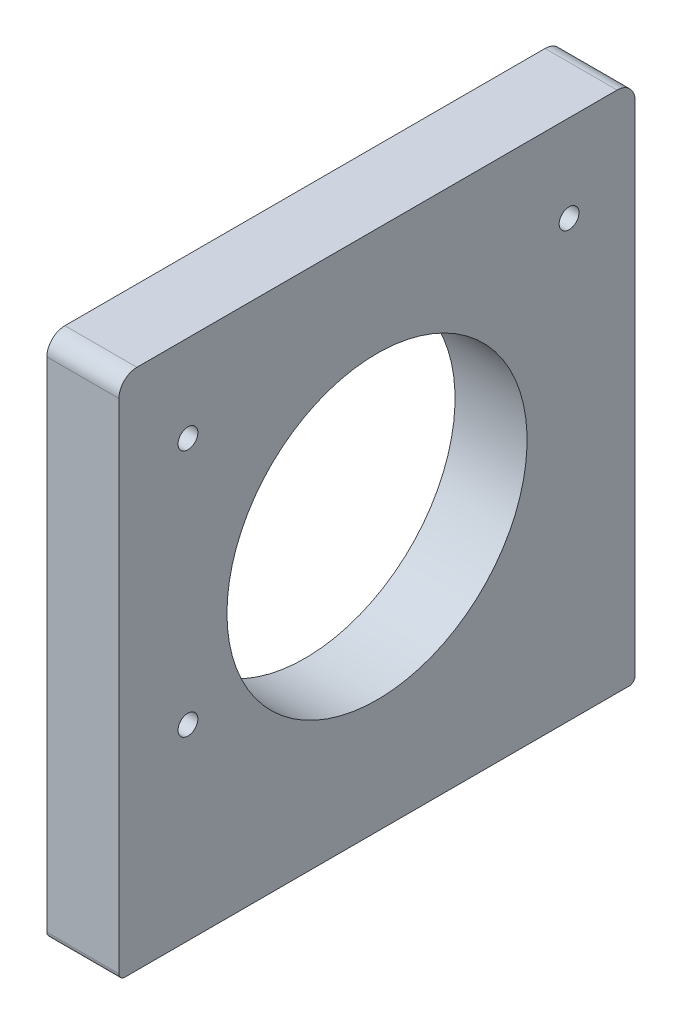
ISO-10303-21;
HEADER;
FILE_DESCRIPTION(('STEP AP214'),'2;1');
FILE_NAME('part.step','',(''),(''),'','','');
FILE_SCHEMA(('AUTOMOTIVE_DESIGN { 1 0 10303 214 1 1 1 1 }'));
ENDSEC;
DATA;
#1=APPLICATION_CONTEXT('core data for automotive mechanical design processes');
#2=APPLICATION_PROTOCOL_DEFINITION('international standard','automotive_design',2000,#1);
#3=PRODUCT_CONTEXT('',#1,'mechanical');
#4=PRODUCT('Part','Part','',(#3));
#5=PRODUCT_RELATED_PRODUCT_CATEGORY('part','',(#4));
#6=PRODUCT_DEFINITION_FORMATION('','',#4);
#7=PRODUCT_DEFINITION_CONTEXT('part definition',#1,'design');
#8=PRODUCT_DEFINITION('design','',#6,#7);
#9=PRODUCT_DEFINITION_SHAPE('','',#8);
#10=(LENGTH_UNIT() NAMED_UNIT(*) SI_UNIT(.MILLI.,.METRE.));
#11=(NAMED_UNIT(*) PLANE_ANGLE_UNIT() SI_UNIT($,.RADIAN.));
#12=(NAMED_UNIT(*) SI_UNIT($,.STERADIAN.) SOLID_ANGLE_UNIT());
#13=UNCERTAINTY_MEASURE_WITH_UNIT(LENGTH_MEASURE(1.E-05),#10,'distance_accuracy_value','');
#14=(GEOMETRIC_REPRESENTATION_CONTEXT(3) GLOBAL_UNCERTAINTY_ASSIGNED_CONTEXT((#13)) GLOBAL_UNIT_ASSIGNED_CONTEXT((#10,
#11,#12)) REPRESENTATION_CONTEXT('',''));
#15=CARTESIAN_POINT('',(0.,0.,0.));
#16=DIRECTION('',(0.,0.,1.));
#17=DIRECTION('',(1.,0.,0.));
#18=AXIS2_PLACEMENT_3D('',#15,#16,#17);
#19=CARTESIAN_POINT('',(0.,12.,86.));
#20=DIRECTION('',(0.,0.,-1.));
#21=DIRECTION('',(-1.,0.,0.));
#22=AXIS2_PLACEMENT_3D('',#19,#20,#21);
#23=PLANE('',#22);
#24=DIRECTION('',(0.,-1.,0.));
#25=VECTOR('',#24,1.);
#26=CARTESIAN_POINT('',(28.,99.,86.));
#27=LINE('',#26,#25);
#28=CARTESIAN_POINT('',(28.,96.,86.));
#29=VERTEX_POINT('',#28);
#30=CARTESIAN_POINT('',(28.,13.,86.));
#31=VERTEX_POINT('',#30);
#32=EDGE_CURVE('E124',#29,#31,#27,.T.);
#33=ORIENTED_EDGE('',*,*,#32,.T.);
#34=DIRECTION('',(-1.,0.,0.));
#35=VECTOR('',#34,1.);
#36=CARTESIAN_POINT('',(0.,13.,86.));
#37=LINE('',#36,#35);
#38=CARTESIAN_POINT('',(40.,13.,86.));
#39=VERTEX_POINT('',#38);
#40=EDGE_CURVE('E11',#31,#39,#37,.F.);
#41=ORIENTED_EDGE('',*,*,#40,.T.);
#42=DIRECTION('',(0.,-1.,0.));
#43=VECTOR('',#42,1.);
#44=CARTESIAN_POINT('',(40.,12.,86.));
#45=LINE('',#44,#43);
#46=CARTESIAN_POINT('',(40.,96.,86.));
#47=VERTEX_POINT('',#46);
#48=EDGE_CURVE('E140',#47,#39,#45,.T.);
#49=ORIENTED_EDGE('',*,*,#48,.F.);
#50=DIRECTION('',(1.,0.,0.));
#51=VECTOR('',#50,1.);
#52=CARTESIAN_POINT('',(0.,96.,86.));
#53=LINE('',#52,#51);
#54=EDGE_CURVE('E104',#47,#29,#53,.F.);
#55=ORIENTED_EDGE('',*,*,#54,.T.);
#56=EDGE_LOOP('',(#33,#41,#49,#55));
#57=FACE_BOUND('',#56,.T.);
#58=ADVANCED_FACE('F33',(#57),#23,.F.);
#59=CARTESIAN_POINT('',(40.,12.,0.));
#60=DIRECTION('',(-1.,0.,0.));
#61=DIRECTION('',(0.,0.,1.));
#62=AXIS2_PLACEMENT_3D('',#59,#60,#61);
#63=PLANE('',#62);
#64=CARTESIAN_POINT('',(40.,56.,43.));
#65=DIRECTION('',(-1.,0.,0.));
#66=DIRECTION('',(0.,0.,1.));
#67=AXIS2_PLACEMENT_3D('',#64,#65,#66);
#68=CIRCLE('',#67,25.);
#69=CARTESIAN_POINT('',(40.,56.,68.));
#70=VERTEX_POINT('',#69);
#71=EDGE_CURVE('E382',#70,#70,#68,.T.);
#72=ORIENTED_EDGE('',*,*,#71,.T.);
#73=EDGE_LOOP('',(#72));
#74=FACE_BOUND('',#73,.T.);
#75=CARTESIAN_POINT('',(40.,43.2000000000002,74.4999999999985));
#76=DIRECTION('',(-1.,0.,0.));
#77=DIRECTION('',(0.,0.,1.));
#78=AXIS2_PLACEMENT_3D('',#75,#76,#77);
#79=CIRCLE('',#78,1.65);
#80=CARTESIAN_POINT('',(40.,43.2000000000002,76.1499999999985));
#81=VERTEX_POINT('',#80);
#82=EDGE_CURVE('E369',#81,#81,#79,.T.);
#83=ORIENTED_EDGE('',*,*,#82,.T.);
#84=EDGE_LOOP('',(#83));
#85=FACE_BOUND('',#84,.T.);
#86=CARTESIAN_POINT('',(40.,84.5000000000002,10.9999999999985));
#87=DIRECTION('',(-1.,0.,0.));
#88=DIRECTION('',(0.,0.,1.));
#89=AXIS2_PLACEMENT_3D('',#86,#87,#88);
#90=CIRCLE('',#89,1.65);
#91=CARTESIAN_POINT('',(40.,84.5000000000002,12.6499999999985));
#92=VERTEX_POINT('',#91);
#93=EDGE_CURVE('E375',#92,#92,#90,.T.);
#94=ORIENTED_EDGE('',*,*,#93,.T.);
#95=EDGE_LOOP('',(#94));
#96=FACE_BOUND('',#95,.T.);
#97=CARTESIAN_POINT('',(40.,84.5000000000002,74.4999999999985));
#98=DIRECTION('',(-1.,0.,0.));
#99=DIRECTION('',(0.,0.,1.));
#100=AXIS2_PLACEMENT_3D('',#97,#98,#99);
#101=CIRCLE('',#100,1.65);
#102=CARTESIAN_POINT('',(40.,84.5000000000002,76.1499999999985));
#103=VERTEX_POINT('',#102);
#104=EDGE_CURVE('E127',#103,#103,#101,.T.);
#105=ORIENTED_EDGE('',*,*,#104,.T.);
#106=EDGE_LOOP('',(#105));
#107=FACE_BOUND('',#106,.T.);
#108=DIRECTION('',(0.,0.,1.));
#109=VECTOR('',#108,1.);
#110=CARTESIAN_POINT('',(40.,12.,0.));
#111=LINE('',#110,#109);
#112=CARTESIAN_POINT('',(40.,12.,1.));
#113=VERTEX_POINT('',#112);
#114=CARTESIAN_POINT('',(40.,12.,85.));
#115=VERTEX_POINT('',#114);
#116=EDGE_CURVE('E164',#113,#115,#111,.T.);
#117=ORIENTED_EDGE('',*,*,#116,.F.);
#118=CARTESIAN_POINT('',(40.,13.,1.));
#119=DIRECTION('',(-1.,0.,0.));
#120=DIRECTION('',(0.,0.,1.));
#121=AXIS2_PLACEMENT_3D('',#118,#119,#120);
#122=CIRCLE('',#121,1.);
#123=CARTESIAN_POINT('',(40.,13.,0.));
#124=VERTEX_POINT('',#123);
#125=EDGE_CURVE('E41',#113,#124,#122,.F.);
#126=ORIENTED_EDGE('',*,*,#125,.T.);
#127=DIRECTION('',(0.,-1.,0.));
#128=VECTOR('',#127,1.);
#129=CARTESIAN_POINT('',(40.,12.,0.));
#130=LINE('',#129,#128);
#131=CARTESIAN_POINT('',(40.,96.,0.));
#132=VERTEX_POINT('',#131);
#133=EDGE_CURVE('E137',#132,#124,#130,.T.);
#134=ORIENTED_EDGE('',*,*,#133,.F.);
#135=CARTESIAN_POINT('',(40.,96.,3.));
#136=DIRECTION('',(-1.,0.,0.));
#137=DIRECTION('',(0.,0.,1.));
#138=AXIS2_PLACEMENT_3D('',#135,#136,#137);
#139=CIRCLE('',#138,3.);
#140=CARTESIAN_POINT('',(40.,99.,3.));
#141=VERTEX_POINT('',#140);
#142=EDGE_CURVE('E106',#132,#141,#139,.F.);
#143=ORIENTED_EDGE('',*,*,#142,.T.);
#144=DIRECTION('',(0.,0.,-1.));
#145=VECTOR('',#144,1.);
#146=CARTESIAN_POINT('',(40.,99.,0.));
#147=LINE('',#146,#145);
#148=CARTESIAN_POINT('',(40.,99.,83.));
#149=VERTEX_POINT('',#148);
#150=EDGE_CURVE('E113',#149,#141,#147,.T.);
#151=ORIENTED_EDGE('',*,*,#150,.F.);
#152=CARTESIAN_POINT('',(40.,96.,83.));
#153=DIRECTION('',(-1.,0.,0.));
#154=DIRECTION('',(0.,0.,1.));
#155=AXIS2_PLACEMENT_3D('',#152,#153,#154);
#156=CIRCLE('',#155,3.);
#157=EDGE_CURVE('E99',#149,#47,#156,.F.);
#158=ORIENTED_EDGE('',*,*,#157,.T.);
#159=ORIENTED_EDGE('',*,*,#48,.T.);
#160=CARTESIAN_POINT('',(40.,13.,85.));
#161=DIRECTION('',(-1.,0.,0.));
#162=DIRECTION('',(0.,0.,1.));
#163=AXIS2_PLACEMENT_3D('',#160,#161,#162);
#164=CIRCLE('',#163,1.);
#165=EDGE_CURVE('E53',#39,#115,#164,.F.);
#166=ORIENTED_EDGE('',*,*,#165,.T.);
#167=EDGE_LOOP('',(#117,#126,#134,#143,#151,#158,#159,#166));
#168=FACE_BOUND('',#167,.T.);
#169=ADVANCED_FACE('F119',(#74,#85,#96,#107,#168),#63,.F.);
#170=CARTESIAN_POINT('',(0.,12.,0.));
#171=DIRECTION('',(0.,0.,1.));
#172=DIRECTION('',(1.,0.,0.));
#173=AXIS2_PLACEMENT_3D('',#170,#171,#172);
#174=PLANE('',#173);
#175=ORIENTED_EDGE('',*,*,#133,.T.);
#176=DIRECTION('',(-1.,0.,0.));
#177=VECTOR('',#176,1.);
#178=CARTESIAN_POINT('',(0.,13.,0.));
#179=LINE('',#178,#177);
#180=CARTESIAN_POINT('',(28.,13.,0.));
#181=VERTEX_POINT('',#180);
#182=EDGE_CURVE('E151',#124,#181,#179,.T.);
#183=ORIENTED_EDGE('',*,*,#182,.T.);
#184=DIRECTION('',(0.,-1.,0.));
#185=VECTOR('',#184,1.);
#186=CARTESIAN_POINT('',(28.,99.,0.));
#187=LINE('',#186,#185);
#188=CARTESIAN_POINT('',(28.,96.,0.));
#189=VERTEX_POINT('',#188);
#190=EDGE_CURVE('E134',#189,#181,#187,.T.);
#191=ORIENTED_EDGE('',*,*,#190,.F.);
#192=DIRECTION('',(-1.,0.,0.));
#193=VECTOR('',#192,1.);
#194=CARTESIAN_POINT('',(0.,96.,0.));
#195=LINE('',#194,#193);
#196=EDGE_CURVE('E149',#189,#132,#195,.F.);
#197=ORIENTED_EDGE('',*,*,#196,.T.);
#198=EDGE_LOOP('',(#175,#183,#191,#197));
#199=FACE_BOUND('',#198,.T.);
#200=ADVANCED_FACE('F169',(#199),#174,.F.);
#201=CARTESIAN_POINT('',(28.,99.,0.));
#202=DIRECTION('',(1.,0.,0.));
#203=DIRECTION('',(0.,0.,-1.));
#204=AXIS2_PLACEMENT_3D('',#201,#202,#203);
#205=PLANE('',#204);
#206=CARTESIAN_POINT('',(28.,56.,43.));
#207=DIRECTION('',(-1.,0.,0.));
#208=DIRECTION('',(0.,0.,1.));
#209=AXIS2_PLACEMENT_3D('',#206,#207,#208);
#210=CIRCLE('',#209,25.);
#211=CARTESIAN_POINT('',(28.,56.,68.));
#212=VERTEX_POINT('',#211);
#213=EDGE_CURVE('E357',#212,#212,#210,.T.);
#214=ORIENTED_EDGE('',*,*,#213,.F.);
#215=EDGE_LOOP('',(#214));
#216=FACE_BOUND('',#215,.T.);
#217=CARTESIAN_POINT('',(28.,43.2000000000002,74.4999999999985));
#218=DIRECTION('',(-1.,0.,0.));
#219=DIRECTION('',(0.,0.,1.));
#220=AXIS2_PLACEMENT_3D('',#217,#218,#219);
#221=CIRCLE('',#220,1.65);
#222=CARTESIAN_POINT('',(28.,43.2000000000002,76.1499999999985));
#223=VERTEX_POINT('',#222);
#224=EDGE_CURVE('E361',#223,#223,#221,.T.);
#225=ORIENTED_EDGE('',*,*,#224,.F.);
#226=EDGE_LOOP('',(#225));
#227=FACE_BOUND('',#226,.T.);
#228=CARTESIAN_POINT('',(28.,84.5000000000002,10.9999999999985));
#229=DIRECTION('',(-1.,0.,0.));
#230=DIRECTION('',(0.,0.,1.));
#231=AXIS2_PLACEMENT_3D('',#228,#229,#230);
#232=CIRCLE('',#231,1.65);
#233=CARTESIAN_POINT('',(28.,84.5000000000002,12.6499999999985));
#234=VERTEX_POINT('',#233);
#235=EDGE_CURVE('E365',#234,#234,#232,.T.);
#236=ORIENTED_EDGE('',*,*,#235,.F.);
#237=EDGE_LOOP('',(#236));
#238=FACE_BOUND('',#237,.T.);
#239=CARTESIAN_POINT('',(28.,84.5000000000002,74.4999999999985));
#240=DIRECTION('',(-1.,0.,0.));
#241=DIRECTION('',(0.,0.,1.));
#242=AXIS2_PLACEMENT_3D('',#239,#240,#241);
#243=CIRCLE('',#242,1.65);
#244=CARTESIAN_POINT('',(28.,84.5000000000002,76.1499999999985));
#245=VERTEX_POINT('',#244);
#246=EDGE_CURVE('E130',#245,#245,#243,.T.);
#247=ORIENTED_EDGE('',*,*,#246,.F.);
#248=EDGE_LOOP('',(#247));
#249=FACE_BOUND('',#248,.T.);
#250=ORIENTED_EDGE('',*,*,#190,.T.);
#251=CARTESIAN_POINT('',(28.,13.,1.));
#252=DIRECTION('',(1.,0.,0.));
#253=DIRECTION('',(0.,0.,-1.));
#254=AXIS2_PLACEMENT_3D('',#251,#252,#253);
#255=CIRCLE('',#254,1.);
#256=CARTESIAN_POINT('',(28.,12.,1.));
#257=VERTEX_POINT('',#256);
#258=EDGE_CURVE('E156',#181,#257,#255,.F.);
#259=ORIENTED_EDGE('',*,*,#258,.T.);
#260=DIRECTION('',(0.,0.,1.));
#261=VECTOR('',#260,1.);
#262=CARTESIAN_POINT('',(28.,12.,0.));
#263=LINE('',#262,#261);
#264=CARTESIAN_POINT('',(28.,12.,85.));
#265=VERTEX_POINT('',#264);
#266=EDGE_CURVE('E122',#257,#265,#263,.T.);
#267=ORIENTED_EDGE('',*,*,#266,.T.);
#268=CARTESIAN_POINT('',(28.,13.,85.));
#269=DIRECTION('',(1.,0.,0.));
#270=DIRECTION('',(0.,0.,-1.));
#271=AXIS2_PLACEMENT_3D('',#268,#269,#270);
#272=CIRCLE('',#271,1.);
#273=EDGE_CURVE('E154',#265,#31,#272,.F.);
#274=ORIENTED_EDGE('',*,*,#273,.T.);
#275=ORIENTED_EDGE('',*,*,#32,.F.);
#276=CARTESIAN_POINT('',(28.,96.,83.));
#277=DIRECTION('',(1.,0.,0.));
#278=DIRECTION('',(0.,0.,-1.));
#279=AXIS2_PLACEMENT_3D('',#276,#277,#278);
#280=CIRCLE('',#279,3.);
#281=CARTESIAN_POINT('',(28.,99.,83.));
#282=VERTEX_POINT('',#281);
#283=EDGE_CURVE('E147',#29,#282,#280,.F.);
#284=ORIENTED_EDGE('',*,*,#283,.T.);
#285=DIRECTION('',(0.,0.,1.));
#286=VECTOR('',#285,1.);
#287=CARTESIAN_POINT('',(28.,99.,0.));
#288=LINE('',#287,#286);
#289=CARTESIAN_POINT('',(28.,99.,3.));
#290=VERTEX_POINT('',#289);
#291=EDGE_CURVE('E116',#290,#282,#288,.T.);
#292=ORIENTED_EDGE('',*,*,#291,.F.);
#293=CARTESIAN_POINT('',(28.,96.,3.));
#294=DIRECTION('',(1.,0.,0.));
#295=DIRECTION('',(0.,0.,-1.));
#296=AXIS2_PLACEMENT_3D('',#293,#294,#295);
#297=CIRCLE('',#296,3.);
#298=EDGE_CURVE('E145',#290,#189,#297,.F.);
#299=ORIENTED_EDGE('',*,*,#298,.T.);
#300=EDGE_LOOP('',(#250,#259,#267,#274,#275,#284,#292,#299));
#301=FACE_BOUND('',#300,.T.);
#302=ADVANCED_FACE('F175',(#216,#227,#238,#249,#301),#205,.F.);
#303=CARTESIAN_POINT('',(0.,99.,0.));
#304=DIRECTION('',(0.,-1.,0.));
#305=DIRECTION('',(0.,0.,-1.));
#306=AXIS2_PLACEMENT_3D('',#303,#304,#305);
#307=PLANE('',#306);
#308=ORIENTED_EDGE('',*,*,#291,.T.);
#309=DIRECTION('',(1.,0.,0.));
#310=VECTOR('',#309,1.);
#311=CARTESIAN_POINT('',(0.,99.,83.));
#312=LINE('',#311,#310);
#313=EDGE_CURVE('E103',#282,#149,#312,.T.);
#314=ORIENTED_EDGE('',*,*,#313,.T.);
#315=ORIENTED_EDGE('',*,*,#150,.T.);
#316=DIRECTION('',(-1.,0.,0.));
#317=VECTOR('',#316,1.);
#318=CARTESIAN_POINT('',(0.,99.,3.));
#319=LINE('',#318,#317);
#320=EDGE_CURVE('E117',#141,#290,#319,.T.);
#321=ORIENTED_EDGE('',*,*,#320,.T.);
#322=EDGE_LOOP('',(#308,#314,#315,#321));
#323=FACE_BOUND('',#322,.T.);
#324=ADVANCED_FACE('F111',(#323),#307,.F.);
#325=CARTESIAN_POINT('',(40.,84.5000000000002,74.4999999999985));
#326=DIRECTION('',(-1.,0.,0.));
#327=DIRECTION('',(0.,0.,1.));
#328=AXIS2_PLACEMENT_3D('',#325,#326,#327);
#329=CYLINDRICAL_SURFACE('',#328,1.65);
#330=ORIENTED_EDGE('',*,*,#104,.F.);
#331=EDGE_LOOP('',(#330));
#332=FACE_BOUND('',#331,.T.);
#333=ORIENTED_EDGE('',*,*,#246,.T.);
#334=EDGE_LOOP('',(#333));
#335=FACE_BOUND('',#334,.T.);
#336=ADVANCED_FACE('F233',(#332,#335),#329,.F.);
#337=CARTESIAN_POINT('',(40.,84.5000000000002,10.9999999999985));
#338=DIRECTION('',(-1.,0.,0.));
#339=DIRECTION('',(0.,0.,1.));
#340=AXIS2_PLACEMENT_3D('',#337,#338,#339);
#341=CYLINDRICAL_SURFACE('',#340,1.65);
#342=ORIENTED_EDGE('',*,*,#93,.F.);
#343=EDGE_LOOP('',(#342));
#344=FACE_BOUND('',#343,.T.);
#345=ORIENTED_EDGE('',*,*,#235,.T.);
#346=EDGE_LOOP('',(#345));
#347=FACE_BOUND('',#346,.T.);
#348=ADVANCED_FACE('F229',(#344,#347),#341,.F.);
#349=CARTESIAN_POINT('',(40.,43.2000000000002,74.4999999999985));
#350=DIRECTION('',(-1.,0.,0.));
#351=DIRECTION('',(0.,0.,1.));
#352=AXIS2_PLACEMENT_3D('',#349,#350,#351);
#353=CYLINDRICAL_SURFACE('',#352,1.65);
#354=ORIENTED_EDGE('',*,*,#82,.F.);
#355=EDGE_LOOP('',(#354));
#356=FACE_BOUND('',#355,.T.);
#357=ORIENTED_EDGE('',*,*,#224,.T.);
#358=EDGE_LOOP('',(#357));
#359=FACE_BOUND('',#358,.T.);
#360=ADVANCED_FACE('F193',(#356,#359),#353,.F.);
#361=CARTESIAN_POINT('',(0.,96.,83.));
#362=DIRECTION('',(1.,0.,0.));
#363=DIRECTION('',(0.,0.,-1.));
#364=AXIS2_PLACEMENT_3D('',#361,#362,#363);
#365=CYLINDRICAL_SURFACE('',#364,3.);
#366=ORIENTED_EDGE('',*,*,#283,.F.);
#367=ORIENTED_EDGE('',*,*,#54,.F.);
#368=ORIENTED_EDGE('',*,*,#157,.F.);
#369=ORIENTED_EDGE('',*,*,#313,.F.);
#370=EDGE_LOOP('',(#366,#367,#368,#369));
#371=FACE_BOUND('',#370,.T.);
#372=ADVANCED_FACE('F102',(#371),#365,.T.);
#373=CARTESIAN_POINT('',(0.,96.,3.));
#374=DIRECTION('',(-1.,0.,0.));
#375=DIRECTION('',(0.,0.,1.));
#376=AXIS2_PLACEMENT_3D('',#373,#374,#375);
#377=CYLINDRICAL_SURFACE('',#376,3.);
#378=ORIENTED_EDGE('',*,*,#142,.F.);
#379=ORIENTED_EDGE('',*,*,#196,.F.);
#380=ORIENTED_EDGE('',*,*,#298,.F.);
#381=ORIENTED_EDGE('',*,*,#320,.F.);
#382=EDGE_LOOP('',(#378,#379,#380,#381));
#383=FACE_BOUND('',#382,.T.);
#384=ADVANCED_FACE('F192',(#383),#377,.T.);
#385=CARTESIAN_POINT('',(40.,56.,43.));
#386=DIRECTION('',(-1.,0.,0.));
#387=DIRECTION('',(0.,0.,1.));
#388=AXIS2_PLACEMENT_3D('',#385,#386,#387);
#389=CYLINDRICAL_SURFACE('',#388,25.);
#390=ORIENTED_EDGE('',*,*,#71,.F.);
#391=EDGE_LOOP('',(#390));
#392=FACE_BOUND('',#391,.T.);
#393=ORIENTED_EDGE('',*,*,#213,.T.);
#394=EDGE_LOOP('',(#393));
#395=FACE_BOUND('',#394,.T.);
#396=ADVANCED_FACE('F195',(#392,#395),#389,.F.);
#397=CARTESIAN_POINT('',(40.,12.,0.));
#398=DIRECTION('',(0.,1.,0.));
#399=DIRECTION('',(0.,0.,1.));
#400=AXIS2_PLACEMENT_3D('',#397,#398,#399);
#401=PLANE('',#400);
#402=CARTESIAN_POINT('',(34.,12.,10.0000000000001));
#403=DIRECTION('',(0.,-1.,0.));
#404=DIRECTION('',(0.,0.,-1.));
#405=AXIS2_PLACEMENT_3D('',#402,#403,#404);
#406=CIRCLE('',#405,2.1);
#407=CARTESIAN_POINT('',(34.,12.,7.90000000000006));
#408=VERTEX_POINT('',#407);
#409=EDGE_CURVE('E395',#408,#408,#406,.T.);
#410=ORIENTED_EDGE('',*,*,#409,.F.);
#411=EDGE_LOOP('',(#410));
#412=FACE_BOUND('',#411,.T.);
#413=CARTESIAN_POINT('',(34.,12.,76.));
#414=DIRECTION('',(0.,-1.,0.));
#415=DIRECTION('',(0.,0.,-1.));
#416=AXIS2_PLACEMENT_3D('',#413,#414,#415);
#417=CIRCLE('',#416,2.1);
#418=CARTESIAN_POINT('',(34.,12.,73.9));
#419=VERTEX_POINT('',#418);
#420=EDGE_CURVE('E389',#419,#419,#417,.T.);
#421=ORIENTED_EDGE('',*,*,#420,.F.);
#422=EDGE_LOOP('',(#421));
#423=FACE_BOUND('',#422,.T.);
#424=ORIENTED_EDGE('',*,*,#266,.F.);
#425=DIRECTION('',(-1.,0.,0.));
#426=VECTOR('',#425,1.);
#427=CARTESIAN_POINT('',(40.,12.,1.));
#428=LINE('',#427,#426);
#429=EDGE_CURVE('E161',#257,#113,#428,.F.);
#430=ORIENTED_EDGE('',*,*,#429,.T.);
#431=ORIENTED_EDGE('',*,*,#116,.T.);
#432=DIRECTION('',(-1.,0.,0.));
#433=VECTOR('',#432,1.);
#434=CARTESIAN_POINT('',(40.,12.,85.));
#435=LINE('',#434,#433);
#436=EDGE_CURVE('E158',#115,#265,#435,.T.);
#437=ORIENTED_EDGE('',*,*,#436,.T.);
#438=EDGE_LOOP('',(#424,#430,#431,#437));
#439=FACE_BOUND('',#438,.T.);
#440=ADVANCED_FACE('F177',(#412,#423,#439),#401,.F.);
#441=CARTESIAN_POINT('',(34.,24.,76.));
#442=DIRECTION('',(0.,-1.,0.));
#443=DIRECTION('',(0.,0.,-1.));
#444=AXIS2_PLACEMENT_3D('',#441,#442,#443);
#445=CYLINDRICAL_SURFACE('',#444,2.1);
#446=CARTESIAN_POINT('',(34.,24.,76.));
#447=DIRECTION('',(0.,-1.,0.));
#448=DIRECTION('',(0.,0.,-1.));
#449=AXIS2_PLACEMENT_3D('',#446,#447,#448);
#450=CIRCLE('',#449,2.1);
#451=CARTESIAN_POINT('',(34.,24.,73.9));
#452=VERTEX_POINT('',#451);
#453=EDGE_CURVE('E388',#452,#452,#450,.T.);
#454=ORIENTED_EDGE('',*,*,#453,.F.);
#455=EDGE_LOOP('',(#454));
#456=FACE_BOUND('',#455,.T.);
#457=ORIENTED_EDGE('',*,*,#420,.T.);
#458=EDGE_LOOP('',(#457));
#459=FACE_BOUND('',#458,.T.);
#460=ADVANCED_FACE('F216',(#456,#459),#445,.F.);
#461=CARTESIAN_POINT('',(34.,24.,76.));
#462=DIRECTION('',(0.,-1.,0.));
#463=DIRECTION('',(0.,0.,-1.));
#464=AXIS2_PLACEMENT_3D('',#461,#462,#463);
#465=PLANE('',#464);
#466=ORIENTED_EDGE('',*,*,#453,.T.);
#467=EDGE_LOOP('',(#466));
#468=FACE_BOUND('',#467,.T.);
#469=ADVANCED_FACE('F209',(#468),#465,.T.);
#470=CARTESIAN_POINT('',(34.,24.,10.0000000000001));
#471=DIRECTION('',(0.,-1.,0.));
#472=DIRECTION('',(0.,0.,-1.));
#473=AXIS2_PLACEMENT_3D('',#470,#471,#472);
#474=CYLINDRICAL_SURFACE('',#473,2.1);
#475=CARTESIAN_POINT('',(34.,24.,10.0000000000001));
#476=DIRECTION('',(0.,-1.,0.));
#477=DIRECTION('',(0.,0.,-1.));
#478=AXIS2_PLACEMENT_3D('',#475,#476,#477);
#479=CIRCLE('',#478,2.1);
#480=CARTESIAN_POINT('',(34.,24.,7.90000000000006));
#481=VERTEX_POINT('',#480);
#482=EDGE_CURVE('E392',#481,#481,#479,.T.);
#483=ORIENTED_EDGE('',*,*,#482,.F.);
#484=EDGE_LOOP('',(#483));
#485=FACE_BOUND('',#484,.T.);
#486=ORIENTED_EDGE('',*,*,#409,.T.);
#487=EDGE_LOOP('',(#486));
#488=FACE_BOUND('',#487,.T.);
#489=ADVANCED_FACE('F203',(#485,#488),#474,.F.);
#490=CARTESIAN_POINT('',(34.,24.,10.0000000000001));
#491=DIRECTION('',(0.,-1.,0.));
#492=DIRECTION('',(0.,0.,-1.));
#493=AXIS2_PLACEMENT_3D('',#490,#491,#492);
#494=PLANE('',#493);
#495=ORIENTED_EDGE('',*,*,#482,.T.);
#496=EDGE_LOOP('',(#495));
#497=FACE_BOUND('',#496,.T.);
#498=ADVANCED_FACE('F198',(#497),#494,.T.);
#499=CARTESIAN_POINT('',(0.,13.,1.));
#500=DIRECTION('',(-1.,0.,0.));
#501=DIRECTION('',(0.,0.,1.));
#502=AXIS2_PLACEMENT_3D('',#499,#500,#501);
#503=CYLINDRICAL_SURFACE('',#502,1.);
#504=ORIENTED_EDGE('',*,*,#125,.F.);
#505=ORIENTED_EDGE('',*,*,#429,.F.);
#506=ORIENTED_EDGE('',*,*,#258,.F.);
#507=ORIENTED_EDGE('',*,*,#182,.F.);
#508=EDGE_LOOP('',(#504,#505,#506,#507));
#509=FACE_BOUND('',#508,.T.);
#510=ADVANCED_FACE('F172',(#509),#503,.T.);
#511=CARTESIAN_POINT('',(40.,13.,85.));
#512=DIRECTION('',(-1.,0.,0.));
#513=DIRECTION('',(0.,0.,1.));
#514=AXIS2_PLACEMENT_3D('',#511,#512,#513);
#515=CYLINDRICAL_SURFACE('',#514,1.);
#516=ORIENTED_EDGE('',*,*,#165,.F.);
#517=ORIENTED_EDGE('',*,*,#40,.F.);
#518=ORIENTED_EDGE('',*,*,#273,.F.);
#519=ORIENTED_EDGE('',*,*,#436,.F.);
#520=EDGE_LOOP('',(#516,#517,#518,#519));
#521=FACE_BOUND('',#520,.T.);
#522=ADVANCED_FACE('F35',(#521),#515,.T.);
#523=CLOSED_SHELL('',(#58,#169,#200,#302,#324,#336,#348,#360,#372,#384,#396,#440,#460,#469,#489,
#498,#510,#522));
#524=MANIFOLD_SOLID_BREP('B2',#523);
#525=ADVANCED_BREP_SHAPE_REPRESENTATION('',(#18,#524),#14);
#526=SHAPE_DEFINITION_REPRESENTATION(#9,#525);
ENDSEC;
END-ISO-10303-21;
